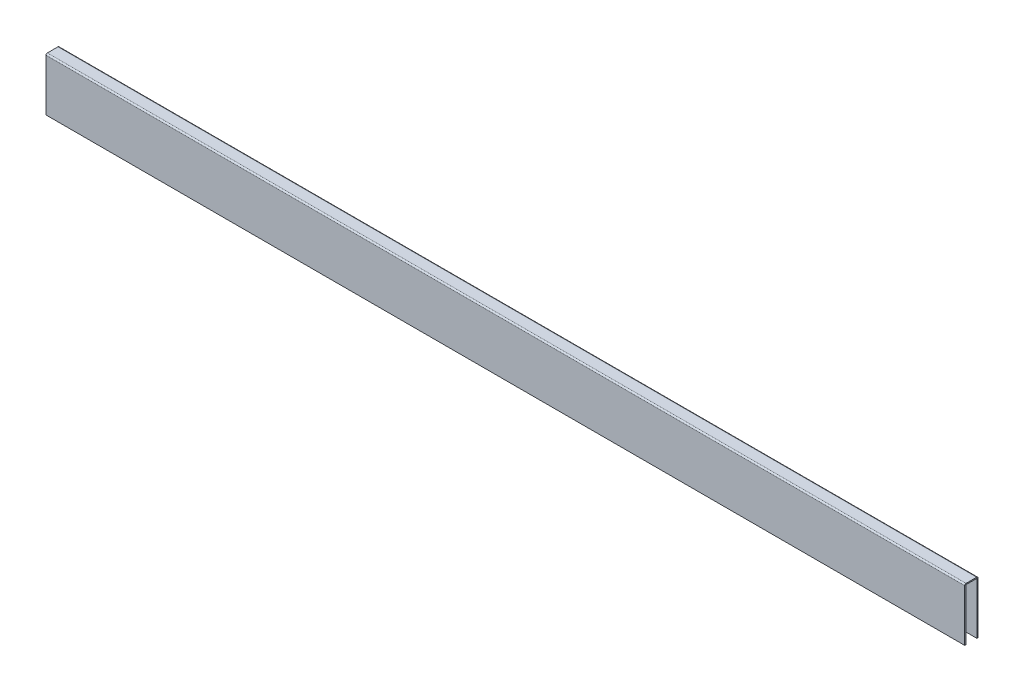
ISO-10303-21;
HEADER;
FILE_DESCRIPTION(('STEP AP214'),'2;1');
FILE_NAME('part.step','',(''),(''),'','','');
FILE_SCHEMA(('AUTOMOTIVE_DESIGN { 1 0 10303 214 1 1 1 1 }'));
ENDSEC;
DATA;
#1=APPLICATION_CONTEXT('core data for automotive mechanical design processes');
#2=APPLICATION_PROTOCOL_DEFINITION('international standard','automotive_design',2000,#1);
#3=PRODUCT_CONTEXT('',#1,'mechanical');
#4=PRODUCT('Part','Part','',(#3));
#5=PRODUCT_RELATED_PRODUCT_CATEGORY('part','',(#4));
#6=PRODUCT_DEFINITION_FORMATION('','',#4);
#7=PRODUCT_DEFINITION_CONTEXT('part definition',#1,'design');
#8=PRODUCT_DEFINITION('design','',#6,#7);
#9=PRODUCT_DEFINITION_SHAPE('','',#8);
#10=(LENGTH_UNIT() NAMED_UNIT(*) SI_UNIT(.MILLI.,.METRE.));
#11=(NAMED_UNIT(*) PLANE_ANGLE_UNIT() SI_UNIT($,.RADIAN.));
#12=(NAMED_UNIT(*) SI_UNIT($,.STERADIAN.) SOLID_ANGLE_UNIT());
#13=UNCERTAINTY_MEASURE_WITH_UNIT(LENGTH_MEASURE(1.E-05),#10,'distance_accuracy_value','');
#14=(GEOMETRIC_REPRESENTATION_CONTEXT(3) GLOBAL_UNCERTAINTY_ASSIGNED_CONTEXT((#13)) GLOBAL_UNIT_ASSIGNED_CONTEXT((#10,
#11,#12)) REPRESENTATION_CONTEXT('',''));
#15=CARTESIAN_POINT('',(0.,0.,0.));
#16=DIRECTION('',(0.,0.,1.));
#17=DIRECTION('',(1.,0.,0.));
#18=AXIS2_PLACEMENT_3D('',#15,#16,#17);
#19=CARTESIAN_POINT('',(50.8,0.,-0.5842));
#20=DIRECTION('',(1.,0.,0.));
#21=DIRECTION('',(0.,0.,-1.));
#22=AXIS2_PLACEMENT_3D('',#19,#20,#21);
#23=PLANE('',#22);
#24=DIRECTION('',(0.,1.,0.));
#25=VECTOR('',#24,1.);
#26=CARTESIAN_POINT('',(50.8,0.,-0.5842));
#27=LINE('',#26,#25);
#28=CARTESIAN_POINT('',(50.8,0.,-0.5842));
#29=VERTEX_POINT('',#28);
#30=CARTESIAN_POINT('',(50.8,0.127,-0.5842));
#31=VERTEX_POINT('',#30);
#32=EDGE_CURVE('E11',#29,#31,#27,.T.);
#33=ORIENTED_EDGE('',*,*,#32,.F.);
#34=CARTESIAN_POINT('',(50.8,-0.0254,-0.5842));
#35=DIRECTION('',(-1.,0.,0.));
#36=DIRECTION('',(0.,0.,1.));
#37=AXIS2_PLACEMENT_3D('',#34,#35,#36);
#38=CIRCLE('',#37,0.0254);
#39=CARTESIAN_POINT('',(50.8,-0.0254,-0.6096));
#40=VERTEX_POINT('',#39);
#41=EDGE_CURVE('E245',#40,#29,#38,.F.);
#42=ORIENTED_EDGE('',*,*,#41,.F.);
#43=DIRECTION('',(0.,0.,1.));
#44=VECTOR('',#43,1.);
#45=CARTESIAN_POINT('',(50.8,-0.0253999999999999,-0.7366));
#46=LINE('',#45,#44);
#47=CARTESIAN_POINT('',(50.8,-0.0253999999999999,-0.7366));
#48=VERTEX_POINT('',#47);
#49=EDGE_CURVE('E43',#48,#40,#46,.T.);
#50=ORIENTED_EDGE('',*,*,#49,.F.);
#51=CARTESIAN_POINT('',(50.8,-0.0254,-0.5842));
#52=DIRECTION('',(1.,0.,0.));
#53=DIRECTION('',(0.,0.,-1.));
#54=AXIS2_PLACEMENT_3D('',#51,#52,#53);
#55=CIRCLE('',#54,0.1524);
#56=EDGE_CURVE('E144',#48,#31,#55,.T.);
#57=ORIENTED_EDGE('',*,*,#56,.T.);
#58=EDGE_LOOP('',(#33,#42,#50,#57));
#59=FACE_BOUND('',#58,.T.);
#60=ADVANCED_FACE('F35',(#59),#23,.T.);
#61=CARTESIAN_POINT('',(50.8,-0.0253999999999999,-0.7366));
#62=DIRECTION('',(1.,0.,0.));
#63=DIRECTION('',(0.,0.,-1.));
#64=AXIS2_PLACEMENT_3D('',#61,#62,#63);
#65=PLANE('',#64);
#66=DIRECTION('',(0.,0.,1.));
#67=VECTOR('',#66,1.);
#68=CARTESIAN_POINT('',(50.8,0.,0.6096));
#69=LINE('',#68,#67);
#70=CARTESIAN_POINT('',(50.8,0.,0.5842));
#71=VERTEX_POINT('',#70);
#72=EDGE_CURVE('E138',#29,#71,#69,.T.);
#73=ORIENTED_EDGE('',*,*,#72,.F.);
#74=ORIENTED_EDGE('',*,*,#32,.T.);
#75=DIRECTION('',(0.,0.,-1.));
#76=VECTOR('',#75,1.);
#77=CARTESIAN_POINT('',(50.8,0.127,0.6096));
#78=LINE('',#77,#76);
#79=CARTESIAN_POINT('',(50.8,0.127,0.5842));
#80=VERTEX_POINT('',#79);
#81=EDGE_CURVE('E135',#31,#80,#78,.F.);
#82=ORIENTED_EDGE('',*,*,#81,.T.);
#83=DIRECTION('',(0.,-1.,0.));
#84=VECTOR('',#83,1.);
#85=CARTESIAN_POINT('',(50.8,0.127,0.5842));
#86=LINE('',#85,#84);
#87=EDGE_CURVE('E226',#80,#71,#86,.T.);
#88=ORIENTED_EDGE('',*,*,#87,.T.);
#89=EDGE_LOOP('',(#73,#74,#82,#88));
#90=FACE_BOUND('',#89,.T.);
#91=ADVANCED_FACE('F133',(#90),#65,.T.);
#92=CARTESIAN_POINT('',(-50.8,-0.0254,-0.6096));
#93=DIRECTION('',(-1.,0.,0.));
#94=DIRECTION('',(0.,0.,1.));
#95=AXIS2_PLACEMENT_3D('',#92,#93,#94);
#96=PLANE('',#95);
#97=DIRECTION('',(0.,0.,-1.));
#98=VECTOR('',#97,1.);
#99=CARTESIAN_POINT('',(-50.8,-0.0254,-0.6096));
#100=LINE('',#99,#98);
#101=CARTESIAN_POINT('',(-50.8,-0.0254,-0.6096));
#102=VERTEX_POINT('',#101);
#103=CARTESIAN_POINT('',(-50.8,-0.0253999999999999,-0.7366));
#104=VERTEX_POINT('',#103);
#105=EDGE_CURVE('E231',#102,#104,#100,.T.);
#106=ORIENTED_EDGE('',*,*,#105,.F.);
#107=CARTESIAN_POINT('',(-50.8,-0.0254,-0.5842));
#108=DIRECTION('',(-1.,0.,0.));
#109=DIRECTION('',(0.,0.,1.));
#110=AXIS2_PLACEMENT_3D('',#107,#108,#109);
#111=CIRCLE('',#110,0.0254);
#112=CARTESIAN_POINT('',(-50.8,0.,-0.5842));
#113=VERTEX_POINT('',#112);
#114=EDGE_CURVE('E183',#102,#113,#111,.F.);
#115=ORIENTED_EDGE('',*,*,#114,.T.);
#116=DIRECTION('',(0.,-1.,0.));
#117=VECTOR('',#116,1.);
#118=CARTESIAN_POINT('',(-50.8,0.127,-0.5842));
#119=LINE('',#118,#117);
#120=CARTESIAN_POINT('',(-50.8,0.127,-0.5842));
#121=VERTEX_POINT('',#120);
#122=EDGE_CURVE('E229',#121,#113,#119,.T.);
#123=ORIENTED_EDGE('',*,*,#122,.F.);
#124=CARTESIAN_POINT('',(-50.8,-0.0254,-0.5842));
#125=DIRECTION('',(1.,0.,0.));
#126=DIRECTION('',(0.,0.,-1.));
#127=AXIS2_PLACEMENT_3D('',#124,#125,#126);
#128=CIRCLE('',#127,0.1524);
#129=EDGE_CURVE('E156',#104,#121,#128,.T.);
#130=ORIENTED_EDGE('',*,*,#129,.F.);
#131=EDGE_LOOP('',(#106,#115,#123,#130));
#132=FACE_BOUND('',#131,.T.);
#133=ADVANCED_FACE('F283',(#132),#96,.T.);
#134=CARTESIAN_POINT('',(-50.8,0.127,-0.5842));
#135=DIRECTION('',(-1.,0.,0.));
#136=DIRECTION('',(0.,0.,1.));
#137=AXIS2_PLACEMENT_3D('',#134,#135,#136);
#138=PLANE('',#137);
#139=DIRECTION('',(0.,1.,0.));
#140=VECTOR('',#139,1.);
#141=CARTESIAN_POINT('',(-50.8,0.,-0.6096));
#142=LINE('',#141,#140);
#143=CARTESIAN_POINT('',(-50.8,-5.7404,-0.609599999999999));
#144=VERTEX_POINT('',#143);
#145=EDGE_CURVE('E186',#144,#102,#142,.T.);
#146=ORIENTED_EDGE('',*,*,#145,.T.);
#147=ORIENTED_EDGE('',*,*,#105,.T.);
#148=DIRECTION('',(0.,1.,0.));
#149=VECTOR('',#148,1.);
#150=CARTESIAN_POINT('',(-50.8,0.,-0.7366));
#151=LINE('',#150,#149);
#152=CARTESIAN_POINT('',(-50.8,-5.7404,-0.736599999999999));
#153=VERTEX_POINT('',#152);
#154=EDGE_CURVE('E192',#153,#104,#151,.T.);
#155=ORIENTED_EDGE('',*,*,#154,.F.);
#156=DIRECTION('',(0.,0.,1.));
#157=VECTOR('',#156,1.);
#158=CARTESIAN_POINT('',(-50.8,-5.7404,-0.736599999999999));
#159=LINE('',#158,#157);
#160=EDGE_CURVE('E189',#153,#144,#159,.T.);
#161=ORIENTED_EDGE('',*,*,#160,.T.);
#162=EDGE_LOOP('',(#146,#147,#155,#161));
#163=FACE_BOUND('',#162,.T.);
#164=ADVANCED_FACE('F286',(#163),#138,.T.);
#165=CARTESIAN_POINT('',(50.8,-0.0254,0.6096));
#166=DIRECTION('',(1.,0.,0.));
#167=DIRECTION('',(0.,0.,-1.));
#168=AXIS2_PLACEMENT_3D('',#165,#166,#167);
#169=PLANE('',#168);
#170=DIRECTION('',(0.,0.,1.));
#171=VECTOR('',#170,1.);
#172=CARTESIAN_POINT('',(50.8,-0.0254,0.6096));
#173=LINE('',#172,#171);
#174=CARTESIAN_POINT('',(50.8,-0.0254,0.6096));
#175=VERTEX_POINT('',#174);
#176=CARTESIAN_POINT('',(50.8,-0.0254,0.7366));
#177=VERTEX_POINT('',#176);
#178=EDGE_CURVE('E51',#175,#177,#173,.T.);
#179=ORIENTED_EDGE('',*,*,#178,.F.);
#180=CARTESIAN_POINT('',(50.8,-0.0254,0.5842));
#181=DIRECTION('',(-1.,0.,0.));
#182=DIRECTION('',(0.,0.,1.));
#183=AXIS2_PLACEMENT_3D('',#180,#181,#182);
#184=CIRCLE('',#183,0.0254);
#185=EDGE_CURVE('E255',#71,#175,#184,.F.);
#186=ORIENTED_EDGE('',*,*,#185,.F.);
#187=ORIENTED_EDGE('',*,*,#87,.F.);
#188=CARTESIAN_POINT('',(50.8,-0.0254,0.5842));
#189=DIRECTION('',(1.,0.,0.));
#190=DIRECTION('',(0.,0.,-1.));
#191=AXIS2_PLACEMENT_3D('',#188,#189,#190);
#192=CIRCLE('',#191,0.1524);
#193=EDGE_CURVE('E164',#80,#177,#192,.T.);
#194=ORIENTED_EDGE('',*,*,#193,.T.);
#195=EDGE_LOOP('',(#179,#186,#187,#194));
#196=FACE_BOUND('',#195,.T.);
#197=ADVANCED_FACE('F278',(#196),#169,.T.);
#198=CARTESIAN_POINT('',(50.8,0.127,0.5842));
#199=DIRECTION('',(1.,0.,0.));
#200=DIRECTION('',(0.,0.,-1.));
#201=AXIS2_PLACEMENT_3D('',#198,#199,#200);
#202=PLANE('',#201);
#203=DIRECTION('',(0.,-1.,0.));
#204=VECTOR('',#203,1.);
#205=CARTESIAN_POINT('',(50.8,0.,0.6096));
#206=LINE('',#205,#204);
#207=CARTESIAN_POINT('',(50.8,-5.7404,0.609599999999999));
#208=VERTEX_POINT('',#207);
#209=EDGE_CURVE('E258',#175,#208,#206,.T.);
#210=ORIENTED_EDGE('',*,*,#209,.F.);
#211=ORIENTED_EDGE('',*,*,#178,.T.);
#212=DIRECTION('',(0.,-1.,0.));
#213=VECTOR('',#212,1.);
#214=CARTESIAN_POINT('',(50.8,0.,0.7366));
#215=LINE('',#214,#213);
#216=CARTESIAN_POINT('',(50.8,-5.7404,0.736599999999999));
#217=VERTEX_POINT('',#216);
#218=EDGE_CURVE('E105',#177,#217,#215,.T.);
#219=ORIENTED_EDGE('',*,*,#218,.T.);
#220=DIRECTION('',(0.,0.,1.));
#221=VECTOR('',#220,1.);
#222=CARTESIAN_POINT('',(50.8,-5.7404,0.609599999999999));
#223=LINE('',#222,#221);
#224=EDGE_CURVE('E261',#208,#217,#223,.T.);
#225=ORIENTED_EDGE('',*,*,#224,.F.);
#226=EDGE_LOOP('',(#210,#211,#219,#225));
#227=FACE_BOUND('',#226,.T.);
#228=ADVANCED_FACE('F267',(#227),#202,.T.);
#229=CARTESIAN_POINT('',(-50.8,0.,0.5842));
#230=DIRECTION('',(-1.,0.,0.));
#231=DIRECTION('',(0.,0.,1.));
#232=AXIS2_PLACEMENT_3D('',#229,#230,#231);
#233=PLANE('',#232);
#234=DIRECTION('',(0.,1.,0.));
#235=VECTOR('',#234,1.);
#236=CARTESIAN_POINT('',(-50.8,0.,0.5842));
#237=LINE('',#236,#235);
#238=CARTESIAN_POINT('',(-50.8,0.,0.5842));
#239=VERTEX_POINT('',#238);
#240=CARTESIAN_POINT('',(-50.8,0.127,0.5842));
#241=VERTEX_POINT('',#240);
#242=EDGE_CURVE('E92',#239,#241,#237,.T.);
#243=ORIENTED_EDGE('',*,*,#242,.F.);
#244=CARTESIAN_POINT('',(-50.8,-0.0254,0.5842));
#245=DIRECTION('',(-1.,0.,0.));
#246=DIRECTION('',(0.,0.,1.));
#247=AXIS2_PLACEMENT_3D('',#244,#245,#246);
#248=CIRCLE('',#247,0.0254);
#249=CARTESIAN_POINT('',(-50.8,-0.0254,0.6096));
#250=VERTEX_POINT('',#249);
#251=EDGE_CURVE('E179',#239,#250,#248,.F.);
#252=ORIENTED_EDGE('',*,*,#251,.T.);
#253=DIRECTION('',(0.,0.,-1.));
#254=VECTOR('',#253,1.);
#255=CARTESIAN_POINT('',(-50.8,-0.0254,0.7366));
#256=LINE('',#255,#254);
#257=CARTESIAN_POINT('',(-50.8,-0.0254,0.7366));
#258=VERTEX_POINT('',#257);
#259=EDGE_CURVE('E99',#258,#250,#256,.T.);
#260=ORIENTED_EDGE('',*,*,#259,.F.);
#261=CARTESIAN_POINT('',(-50.8,-0.0254,0.5842));
#262=DIRECTION('',(1.,0.,0.));
#263=DIRECTION('',(0.,0.,-1.));
#264=AXIS2_PLACEMENT_3D('',#261,#262,#263);
#265=CIRCLE('',#264,0.1524);
#266=EDGE_CURVE('E198',#241,#258,#265,.T.);
#267=ORIENTED_EDGE('',*,*,#266,.F.);
#268=EDGE_LOOP('',(#243,#252,#260,#267));
#269=FACE_BOUND('',#268,.T.);
#270=ADVANCED_FACE('F315',(#269),#233,.T.);
#271=CARTESIAN_POINT('',(-50.8,-0.0254,0.7366));
#272=DIRECTION('',(-1.,0.,0.));
#273=DIRECTION('',(0.,0.,1.));
#274=AXIS2_PLACEMENT_3D('',#271,#272,#273);
#275=PLANE('',#274);
#276=DIRECTION('',(0.,0.,1.));
#277=VECTOR('',#276,1.);
#278=CARTESIAN_POINT('',(-50.8,0.,0.6096));
#279=LINE('',#278,#277);
#280=EDGE_CURVE('E181',#113,#239,#279,.T.);
#281=ORIENTED_EDGE('',*,*,#280,.T.);
#282=ORIENTED_EDGE('',*,*,#242,.T.);
#283=DIRECTION('',(0.,0.,-1.));
#284=VECTOR('',#283,1.);
#285=CARTESIAN_POINT('',(-50.8,0.127,0.6096));
#286=LINE('',#285,#284);
#287=EDGE_CURVE('E196',#121,#241,#286,.F.);
#288=ORIENTED_EDGE('',*,*,#287,.F.);
#289=ORIENTED_EDGE('',*,*,#122,.T.);
#290=EDGE_LOOP('',(#281,#282,#288,#289));
#291=FACE_BOUND('',#290,.T.);
#292=ADVANCED_FACE('F318',(#291),#275,.T.);
#293=CARTESIAN_POINT('',(50.8,0.,0.7366));
#294=DIRECTION('',(0.,0.,-1.));
#295=DIRECTION('',(0.,1.,0.));
#296=AXIS2_PLACEMENT_3D('',#293,#294,#295);
#297=PLANE('',#296);
#298=DIRECTION('',(0.,-1.,0.));
#299=VECTOR('',#298,1.);
#300=CARTESIAN_POINT('',(-50.8,0.,0.7366));
#301=LINE('',#300,#299);
#302=CARTESIAN_POINT('',(-50.8,-5.7404,0.736599999999999));
#303=VERTEX_POINT('',#302);
#304=EDGE_CURVE('E170',#258,#303,#301,.T.);
#305=ORIENTED_EDGE('',*,*,#304,.T.);
#306=DIRECTION('',(-1.,0.,0.));
#307=VECTOR('',#306,1.);
#308=CARTESIAN_POINT('',(50.8,-5.7404,0.736599999999999));
#309=LINE('',#308,#307);
#310=EDGE_CURVE('E222',#217,#303,#309,.T.);
#311=ORIENTED_EDGE('',*,*,#310,.F.);
#312=ORIENTED_EDGE('',*,*,#218,.F.);
#313=DIRECTION('',(-1.,0.,0.));
#314=VECTOR('',#313,1.);
#315=CARTESIAN_POINT('',(50.8,-0.0254,0.7366));
#316=LINE('',#315,#314);
#317=EDGE_CURVE('E166',#177,#258,#316,.T.);
#318=ORIENTED_EDGE('',*,*,#317,.T.);
#319=EDGE_LOOP('',(#305,#311,#312,#318));
#320=FACE_BOUND('',#319,.T.);
#321=ADVANCED_FACE('F321',(#320),#297,.F.);
#322=CARTESIAN_POINT('',(50.8,-5.7404,0.609599999999999));
#323=DIRECTION('',(0.,-1.,0.));
#324=DIRECTION('',(0.,0.,-1.));
#325=AXIS2_PLACEMENT_3D('',#322,#323,#324);
#326=PLANE('',#325);
#327=DIRECTION('',(0.,0.,1.));
#328=VECTOR('',#327,1.);
#329=CARTESIAN_POINT('',(-50.8,-5.7404,0.609599999999999));
#330=LINE('',#329,#328);
#331=CARTESIAN_POINT('',(-50.8,-5.7404,0.609599999999999));
#332=VERTEX_POINT('',#331);
#333=EDGE_CURVE('E173',#332,#303,#330,.T.);
#334=ORIENTED_EDGE('',*,*,#333,.F.);
#335=DIRECTION('',(-1.,0.,0.));
#336=VECTOR('',#335,1.);
#337=CARTESIAN_POINT('',(50.8,-5.7404,0.609599999999999));
#338=LINE('',#337,#336);
#339=EDGE_CURVE('E220',#208,#332,#338,.T.);
#340=ORIENTED_EDGE('',*,*,#339,.F.);
#341=ORIENTED_EDGE('',*,*,#224,.T.);
#342=ORIENTED_EDGE('',*,*,#310,.T.);
#343=EDGE_LOOP('',(#334,#340,#341,#342));
#344=FACE_BOUND('',#343,.T.);
#345=ADVANCED_FACE('F266',(#344),#326,.T.);
#346=CARTESIAN_POINT('',(50.8,0.,0.6096));
#347=DIRECTION('',(0.,0.,-1.));
#348=DIRECTION('',(0.,1.,0.));
#349=AXIS2_PLACEMENT_3D('',#346,#347,#348);
#350=PLANE('',#349);
#351=DIRECTION('',(0.,-1.,0.));
#352=VECTOR('',#351,1.);
#353=CARTESIAN_POINT('',(-50.8,0.,0.6096));
#354=LINE('',#353,#352);
#355=EDGE_CURVE('E176',#250,#332,#354,.T.);
#356=ORIENTED_EDGE('',*,*,#355,.F.);
#357=DIRECTION('',(-1.,0.,0.));
#358=VECTOR('',#357,1.);
#359=CARTESIAN_POINT('',(50.8,-0.0254,0.6096));
#360=LINE('',#359,#358);
#361=EDGE_CURVE('E217',#175,#250,#360,.T.);
#362=ORIENTED_EDGE('',*,*,#361,.F.);
#363=ORIENTED_EDGE('',*,*,#209,.T.);
#364=ORIENTED_EDGE('',*,*,#339,.T.);
#365=EDGE_LOOP('',(#356,#362,#363,#364));
#366=FACE_BOUND('',#365,.T.);
#367=ADVANCED_FACE('F271',(#366),#350,.T.);
#368=CARTESIAN_POINT('',(50.8,-0.0254,0.5842));
#369=DIRECTION('',(-1.,0.,0.));
#370=DIRECTION('',(0.,0.,1.));
#371=AXIS2_PLACEMENT_3D('',#368,#369,#370);
#372=CYLINDRICAL_SURFACE('',#371,0.0254);
#373=ORIENTED_EDGE('',*,*,#251,.F.);
#374=DIRECTION('',(-1.,0.,0.));
#375=VECTOR('',#374,1.);
#376=CARTESIAN_POINT('',(50.8,0.,0.5842));
#377=LINE('',#376,#375);
#378=EDGE_CURVE('E214',#71,#239,#377,.T.);
#379=ORIENTED_EDGE('',*,*,#378,.F.);
#380=ORIENTED_EDGE('',*,*,#185,.T.);
#381=ORIENTED_EDGE('',*,*,#361,.T.);
#382=EDGE_LOOP('',(#373,#379,#380,#381));
#383=FACE_BOUND('',#382,.T.);
#384=ADVANCED_FACE('F274',(#383),#372,.F.);
#385=CARTESIAN_POINT('',(50.8,0.,0.6096));
#386=DIRECTION('',(0.,-1.,0.));
#387=DIRECTION('',(0.,0.,-1.));
#388=AXIS2_PLACEMENT_3D('',#385,#386,#387);
#389=PLANE('',#388);
#390=ORIENTED_EDGE('',*,*,#280,.F.);
#391=DIRECTION('',(-1.,0.,0.));
#392=VECTOR('',#391,1.);
#393=CARTESIAN_POINT('',(50.8,0.,-0.5842));
#394=LINE('',#393,#392);
#395=EDGE_CURVE('E211',#29,#113,#394,.T.);
#396=ORIENTED_EDGE('',*,*,#395,.F.);
#397=ORIENTED_EDGE('',*,*,#72,.T.);
#398=ORIENTED_EDGE('',*,*,#378,.T.);
#399=EDGE_LOOP('',(#390,#396,#397,#398));
#400=FACE_BOUND('',#399,.T.);
#401=ADVANCED_FACE('F281',(#400),#389,.T.);
#402=CARTESIAN_POINT('',(50.8,-0.0254,-0.5842));
#403=DIRECTION('',(-1.,0.,0.));
#404=DIRECTION('',(0.,0.,1.));
#405=AXIS2_PLACEMENT_3D('',#402,#403,#404);
#406=CYLINDRICAL_SURFACE('',#405,0.0254);
#407=ORIENTED_EDGE('',*,*,#114,.F.);
#408=DIRECTION('',(-1.,0.,0.));
#409=VECTOR('',#408,1.);
#410=CARTESIAN_POINT('',(50.8,-0.0254,-0.6096));
#411=LINE('',#410,#409);
#412=EDGE_CURVE('E208',#40,#102,#411,.T.);
#413=ORIENTED_EDGE('',*,*,#412,.F.);
#414=ORIENTED_EDGE('',*,*,#41,.T.);
#415=ORIENTED_EDGE('',*,*,#395,.T.);
#416=EDGE_LOOP('',(#407,#413,#414,#415));
#417=FACE_BOUND('',#416,.T.);
#418=ADVANCED_FACE('F244',(#417),#406,.F.);
#419=CARTESIAN_POINT('',(50.8,0.,-0.6096));
#420=DIRECTION('',(0.,0.,1.));
#421=DIRECTION('',(0.,-1.,0.));
#422=AXIS2_PLACEMENT_3D('',#419,#420,#421);
#423=PLANE('',#422);
#424=ORIENTED_EDGE('',*,*,#145,.F.);
#425=DIRECTION('',(-1.,0.,0.));
#426=VECTOR('',#425,1.);
#427=CARTESIAN_POINT('',(50.8,-5.7404,-0.609599999999999));
#428=LINE('',#427,#426);
#429=CARTESIAN_POINT('',(50.8,-5.7404,-0.609599999999999));
#430=VERTEX_POINT('',#429);
#431=EDGE_CURVE('E206',#430,#144,#428,.T.);
#432=ORIENTED_EDGE('',*,*,#431,.F.);
#433=DIRECTION('',(0.,1.,0.));
#434=VECTOR('',#433,1.);
#435=CARTESIAN_POINT('',(50.8,0.,-0.6096));
#436=LINE('',#435,#434);
#437=EDGE_CURVE('E238',#430,#40,#436,.T.);
#438=ORIENTED_EDGE('',*,*,#437,.T.);
#439=ORIENTED_EDGE('',*,*,#412,.T.);
#440=EDGE_LOOP('',(#424,#432,#438,#439));
#441=FACE_BOUND('',#440,.T.);
#442=ADVANCED_FACE('F249',(#441),#423,.T.);
#443=CARTESIAN_POINT('',(50.8,-5.7404,-0.736599999999999));
#444=DIRECTION('',(0.,-1.,0.));
#445=DIRECTION('',(0.,0.,-1.));
#446=AXIS2_PLACEMENT_3D('',#443,#444,#445);
#447=PLANE('',#446);
#448=ORIENTED_EDGE('',*,*,#160,.F.);
#449=DIRECTION('',(-1.,0.,0.));
#450=VECTOR('',#449,1.);
#451=CARTESIAN_POINT('',(50.8,-5.7404,-0.736599999999999));
#452=LINE('',#451,#450);
#453=CARTESIAN_POINT('',(50.8,-5.7404,-0.736599999999999));
#454=VERTEX_POINT('',#453);
#455=EDGE_CURVE('E204',#454,#153,#452,.T.);
#456=ORIENTED_EDGE('',*,*,#455,.F.);
#457=DIRECTION('',(0.,0.,1.));
#458=VECTOR('',#457,1.);
#459=CARTESIAN_POINT('',(50.8,-5.7404,-0.736599999999999));
#460=LINE('',#459,#458);
#461=EDGE_CURVE('E250',#454,#430,#460,.T.);
#462=ORIENTED_EDGE('',*,*,#461,.T.);
#463=ORIENTED_EDGE('',*,*,#431,.T.);
#464=EDGE_LOOP('',(#448,#456,#462,#463));
#465=FACE_BOUND('',#464,.T.);
#466=ADVANCED_FACE('F291',(#465),#447,.T.);
#467=CARTESIAN_POINT('',(50.8,0.,-0.7366));
#468=DIRECTION('',(0.,0.,1.));
#469=DIRECTION('',(0.,-1.,0.));
#470=AXIS2_PLACEMENT_3D('',#467,#468,#469);
#471=PLANE('',#470);
#472=ORIENTED_EDGE('',*,*,#154,.T.);
#473=DIRECTION('',(-1.,0.,0.));
#474=VECTOR('',#473,1.);
#475=CARTESIAN_POINT('',(50.8,-0.0253999999999999,-0.7366));
#476=LINE('',#475,#474);
#477=EDGE_CURVE('E158',#48,#104,#476,.T.);
#478=ORIENTED_EDGE('',*,*,#477,.F.);
#479=DIRECTION('',(0.,1.,0.));
#480=VECTOR('',#479,1.);
#481=CARTESIAN_POINT('',(50.8,0.,-0.7366));
#482=LINE('',#481,#480);
#483=EDGE_CURVE('E149',#454,#48,#482,.T.);
#484=ORIENTED_EDGE('',*,*,#483,.F.);
#485=ORIENTED_EDGE('',*,*,#455,.T.);
#486=EDGE_LOOP('',(#472,#478,#484,#485));
#487=FACE_BOUND('',#486,.T.);
#488=ADVANCED_FACE('F289',(#487),#471,.F.);
#489=CARTESIAN_POINT('',(50.8,-0.0254,-0.5842));
#490=DIRECTION('',(-1.,0.,0.));
#491=DIRECTION('',(0.,0.,1.));
#492=AXIS2_PLACEMENT_3D('',#489,#490,#491);
#493=CYLINDRICAL_SURFACE('',#492,0.1524);
#494=ORIENTED_EDGE('',*,*,#129,.T.);
#495=DIRECTION('',(-1.,0.,0.));
#496=VECTOR('',#495,1.);
#497=CARTESIAN_POINT('',(50.8,0.127,-0.5842));
#498=LINE('',#497,#496);
#499=EDGE_CURVE('E153',#31,#121,#498,.T.);
#500=ORIENTED_EDGE('',*,*,#499,.F.);
#501=ORIENTED_EDGE('',*,*,#56,.F.);
#502=ORIENTED_EDGE('',*,*,#477,.T.);
#503=EDGE_LOOP('',(#494,#500,#501,#502));
#504=FACE_BOUND('',#503,.T.);
#505=ADVANCED_FACE('F154',(#504),#493,.T.);
#506=CARTESIAN_POINT('',(50.8,0.127,0.6096));
#507=DIRECTION('',(0.,-1.,0.));
#508=DIRECTION('',(0.,0.,-1.));
#509=AXIS2_PLACEMENT_3D('',#506,#507,#508);
#510=PLANE('',#509);
#511=ORIENTED_EDGE('',*,*,#287,.T.);
#512=DIRECTION('',(-1.,0.,0.));
#513=VECTOR('',#512,1.);
#514=CARTESIAN_POINT('',(50.8,0.127,0.5842));
#515=LINE('',#514,#513);
#516=EDGE_CURVE('E159',#80,#241,#515,.T.);
#517=ORIENTED_EDGE('',*,*,#516,.F.);
#518=ORIENTED_EDGE('',*,*,#81,.F.);
#519=ORIENTED_EDGE('',*,*,#499,.T.);
#520=EDGE_LOOP('',(#511,#517,#518,#519));
#521=FACE_BOUND('',#520,.T.);
#522=ADVANCED_FACE('F161',(#521),#510,.F.);
#523=CARTESIAN_POINT('',(50.8,-0.0254,0.5842));
#524=DIRECTION('',(-1.,0.,0.));
#525=DIRECTION('',(0.,0.,1.));
#526=AXIS2_PLACEMENT_3D('',#523,#524,#525);
#527=CYLINDRICAL_SURFACE('',#526,0.1524);
#528=ORIENTED_EDGE('',*,*,#266,.T.);
#529=ORIENTED_EDGE('',*,*,#317,.F.);
#530=ORIENTED_EDGE('',*,*,#193,.F.);
#531=ORIENTED_EDGE('',*,*,#516,.T.);
#532=EDGE_LOOP('',(#528,#529,#530,#531));
#533=FACE_BOUND('',#532,.T.);
#534=ADVANCED_FACE('F373',(#533),#527,.T.);
#535=CARTESIAN_POINT('',(50.8,-0.0254,0.5842));
#536=DIRECTION('',(-1.,0.,0.));
#537=DIRECTION('',(0.,0.,1.));
#538=AXIS2_PLACEMENT_3D('',#535,#536,#537);
#539=PLANE('',#538);
#540=ORIENTED_EDGE('',*,*,#483,.T.);
#541=ORIENTED_EDGE('',*,*,#49,.T.);
#542=ORIENTED_EDGE('',*,*,#437,.F.);
#543=ORIENTED_EDGE('',*,*,#461,.F.);
#544=EDGE_LOOP('',(#540,#541,#542,#543));
#545=FACE_BOUND('',#544,.T.);
#546=ADVANCED_FACE('F235',(#545),#539,.F.);
#547=CARTESIAN_POINT('',(-50.8,-0.0254,0.5842));
#548=DIRECTION('',(-1.,0.,0.));
#549=DIRECTION('',(0.,0.,1.));
#550=AXIS2_PLACEMENT_3D('',#547,#548,#549);
#551=PLANE('',#550);
#552=ORIENTED_EDGE('',*,*,#304,.F.);
#553=ORIENTED_EDGE('',*,*,#259,.T.);
#554=ORIENTED_EDGE('',*,*,#355,.T.);
#555=ORIENTED_EDGE('',*,*,#333,.T.);
#556=EDGE_LOOP('',(#552,#553,#554,#555));
#557=FACE_BOUND('',#556,.T.);
#558=ADVANCED_FACE('F393',(#557),#551,.T.);
#559=CLOSED_SHELL('',(#60,#91,#133,#164,#197,#228,#270,#292,#321,#345,#367,#384,#401,#418,#442,
#466,#488,#505,#522,#534,#546,#558));
#560=MANIFOLD_SOLID_BREP('B2',#559);
#561=ADVANCED_BREP_SHAPE_REPRESENTATION('',(#18,#560),#14);
#562=SHAPE_DEFINITION_REPRESENTATION(#9,#561);
ENDSEC;
END-ISO-10303-21;
